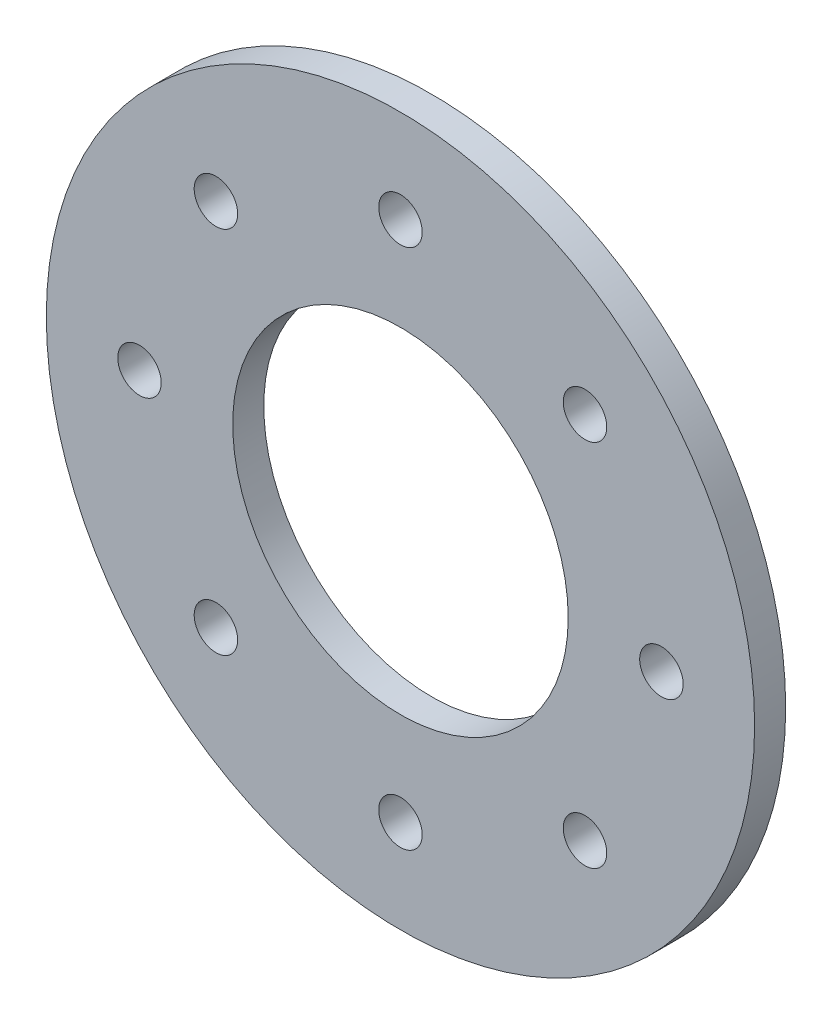
ISO-10303-21;
HEADER;
FILE_DESCRIPTION(('STEP AP214'),'2;1');
FILE_NAME('part.step','',(''),(''),'','','');
FILE_SCHEMA(('AUTOMOTIVE_DESIGN { 1 0 10303 214 1 1 1 1 }'));
ENDSEC;
DATA;
#1=APPLICATION_CONTEXT('core data for automotive mechanical design processes');
#2=APPLICATION_PROTOCOL_DEFINITION('international standard','automotive_design',2000,#1);
#3=PRODUCT_CONTEXT('',#1,'mechanical');
#4=PRODUCT('Part','Part','',(#3));
#5=PRODUCT_RELATED_PRODUCT_CATEGORY('part','',(#4));
#6=PRODUCT_DEFINITION_FORMATION('','',#4);
#7=PRODUCT_DEFINITION_CONTEXT('part definition',#1,'design');
#8=PRODUCT_DEFINITION('design','',#6,#7);
#9=PRODUCT_DEFINITION_SHAPE('','',#8);
#10=(LENGTH_UNIT() NAMED_UNIT(*) SI_UNIT(.MILLI.,.METRE.));
#11=(NAMED_UNIT(*) PLANE_ANGLE_UNIT() SI_UNIT($,.RADIAN.));
#12=(NAMED_UNIT(*) SI_UNIT($,.STERADIAN.) SOLID_ANGLE_UNIT());
#13=UNCERTAINTY_MEASURE_WITH_UNIT(LENGTH_MEASURE(1.E-05),#10,'distance_accuracy_value','');
#14=(GEOMETRIC_REPRESENTATION_CONTEXT(3) GLOBAL_UNCERTAINTY_ASSIGNED_CONTEXT((#13)) GLOBAL_UNIT_ASSIGNED_CONTEXT((#10,
#11,#12)) REPRESENTATION_CONTEXT('',''));
#15=CARTESIAN_POINT('',(0.,0.,0.));
#16=DIRECTION('',(0.,0.,1.));
#17=DIRECTION('',(1.,0.,0.));
#18=AXIS2_PLACEMENT_3D('',#15,#16,#17);
#19=CARTESIAN_POINT('',(0.,0.,5.));
#20=DIRECTION('',(0.,0.,1.));
#21=DIRECTION('',(1.,0.,0.));
#22=AXIS2_PLACEMENT_3D('',#19,#20,#21);
#23=PLANE('',#22);
#24=CARTESIAN_POINT('',(0.,-42.,5.));
#25=DIRECTION('',(0.,0.,1.));
#26=DIRECTION('',(1.,0.,0.));
#27=AXIS2_PLACEMENT_3D('',#24,#25,#26);
#28=CIRCLE('',#27,3.50000000000001);
#29=CARTESIAN_POINT('',(3.50000000000001,-42.,5.));
#30=VERTEX_POINT('',#29);
#31=EDGE_CURVE('E83',#30,#30,#28,.T.);
#32=ORIENTED_EDGE('',*,*,#31,.F.);
#33=EDGE_LOOP('',(#32));
#34=FACE_BOUND('',#33,.T.);
#35=CARTESIAN_POINT('',(42.,0.,5.));
#36=DIRECTION('',(0.,0.,1.));
#37=DIRECTION('',(1.,0.,0.));
#38=AXIS2_PLACEMENT_3D('',#35,#36,#37);
#39=CIRCLE('',#38,3.50000000000001);
#40=CARTESIAN_POINT('',(45.5,0.,5.));
#41=VERTEX_POINT('',#40);
#42=EDGE_CURVE('E71',#41,#41,#39,.T.);
#43=ORIENTED_EDGE('',*,*,#42,.F.);
#44=EDGE_LOOP('',(#43));
#45=FACE_BOUND('',#44,.T.);
#46=CARTESIAN_POINT('',(0.,42.,5.));
#47=DIRECTION('',(0.,0.,1.));
#48=DIRECTION('',(1.,0.,0.));
#49=AXIS2_PLACEMENT_3D('',#46,#47,#48);
#50=CIRCLE('',#49,3.50000000000001);
#51=CARTESIAN_POINT('',(3.5,42.,5.));
#52=VERTEX_POINT('',#51);
#53=EDGE_CURVE('E59',#52,#52,#50,.T.);
#54=ORIENTED_EDGE('',*,*,#53,.F.);
#55=EDGE_LOOP('',(#54));
#56=FACE_BOUND('',#55,.T.);
#57=CARTESIAN_POINT('',(-42.,0.,5.));
#58=DIRECTION('',(0.,0.,1.));
#59=DIRECTION('',(1.,0.,0.));
#60=AXIS2_PLACEMENT_3D('',#57,#58,#59);
#61=CIRCLE('',#60,3.50000000000001);
#62=CARTESIAN_POINT('',(-38.5,0.,5.));
#63=VERTEX_POINT('',#62);
#64=EDGE_CURVE('E47',#63,#63,#61,.T.);
#65=ORIENTED_EDGE('',*,*,#64,.F.);
#66=EDGE_LOOP('',(#65));
#67=FACE_BOUND('',#66,.T.);
#68=CARTESIAN_POINT('',(0.,0.,5.));
#69=DIRECTION('',(0.,0.,1.));
#70=DIRECTION('',(1.,0.,0.));
#71=AXIS2_PLACEMENT_3D('',#68,#69,#70);
#72=CIRCLE('',#71,57.);
#73=CARTESIAN_POINT('',(57.,0.,5.));
#74=VERTEX_POINT('',#73);
#75=EDGE_CURVE('E10',#74,#74,#72,.T.);
#76=ORIENTED_EDGE('',*,*,#75,.T.);
#77=EDGE_LOOP('',(#76));
#78=FACE_BOUND('',#77,.T.);
#79=CARTESIAN_POINT('',(0.,0.,5.));
#80=DIRECTION('',(0.,0.,1.));
#81=DIRECTION('',(1.,0.,0.));
#82=AXIS2_PLACEMENT_3D('',#79,#80,#81);
#83=CIRCLE('',#82,26.999999975);
#84=CARTESIAN_POINT('',(26.999999975,0.,5.));
#85=VERTEX_POINT('',#84);
#86=EDGE_CURVE('E42',#85,#85,#83,.T.);
#87=ORIENTED_EDGE('',*,*,#86,.F.);
#88=EDGE_LOOP('',(#87));
#89=FACE_BOUND('',#88,.T.);
#90=CARTESIAN_POINT('',(-29.698484809835,29.698484809835,5.));
#91=DIRECTION('',(0.,0.,1.));
#92=DIRECTION('',(1.,0.,0.));
#93=AXIS2_PLACEMENT_3D('',#90,#91,#92);
#94=CIRCLE('',#93,3.5);
#95=CARTESIAN_POINT('',(-26.198484809835,29.698484809835,5.));
#96=VERTEX_POINT('',#95);
#97=EDGE_CURVE('E53',#96,#96,#94,.T.);
#98=ORIENTED_EDGE('',*,*,#97,.F.);
#99=EDGE_LOOP('',(#98));
#100=FACE_BOUND('',#99,.T.);
#101=CARTESIAN_POINT('',(29.698484809835,29.698484809835,5.));
#102=DIRECTION('',(0.,0.,1.));
#103=DIRECTION('',(1.,0.,0.));
#104=AXIS2_PLACEMENT_3D('',#101,#102,#103);
#105=CIRCLE('',#104,3.5);
#106=CARTESIAN_POINT('',(33.198484809835,29.698484809835,5.));
#107=VERTEX_POINT('',#106);
#108=EDGE_CURVE('E65',#107,#107,#105,.T.);
#109=ORIENTED_EDGE('',*,*,#108,.F.);
#110=EDGE_LOOP('',(#109));
#111=FACE_BOUND('',#110,.T.);
#112=CARTESIAN_POINT('',(29.698484809835,-29.698484809835,5.));
#113=DIRECTION('',(0.,0.,1.));
#114=DIRECTION('',(1.,0.,0.));
#115=AXIS2_PLACEMENT_3D('',#112,#113,#114);
#116=CIRCLE('',#115,3.5);
#117=CARTESIAN_POINT('',(33.198484809835,-29.698484809835,5.));
#118=VERTEX_POINT('',#117);
#119=EDGE_CURVE('E77',#118,#118,#116,.T.);
#120=ORIENTED_EDGE('',*,*,#119,.F.);
#121=EDGE_LOOP('',(#120));
#122=FACE_BOUND('',#121,.T.);
#123=CARTESIAN_POINT('',(-29.698484809835,-29.698484809835,5.));
#124=DIRECTION('',(0.,0.,1.));
#125=DIRECTION('',(1.,0.,0.));
#126=AXIS2_PLACEMENT_3D('',#123,#124,#125);
#127=CIRCLE('',#126,3.49999999999999);
#128=CARTESIAN_POINT('',(-26.198484809835,-29.698484809835,5.));
#129=VERTEX_POINT('',#128);
#130=EDGE_CURVE('E89',#129,#129,#127,.T.);
#131=ORIENTED_EDGE('',*,*,#130,.F.);
#132=EDGE_LOOP('',(#131));
#133=FACE_BOUND('',#132,.T.);
#134=ADVANCED_FACE('F31',(#34,#45,#56,#67,#78,#89,#100,#111,#122,#133),#23,.T.);
#135=CARTESIAN_POINT('',(0.,0.,0.));
#136=DIRECTION('',(0.,0.,1.));
#137=DIRECTION('',(1.,0.,0.));
#138=AXIS2_PLACEMENT_3D('',#135,#136,#137);
#139=PLANE('',#138);
#140=CARTESIAN_POINT('',(0.,-42.,0.));
#141=DIRECTION('',(0.,0.,1.));
#142=DIRECTION('',(1.,0.,0.));
#143=AXIS2_PLACEMENT_3D('',#140,#141,#142);
#144=CIRCLE('',#143,3.50000000000001);
#145=CARTESIAN_POINT('',(3.50000000000001,-42.,0.));
#146=VERTEX_POINT('',#145);
#147=EDGE_CURVE('E86',#146,#146,#144,.T.);
#148=ORIENTED_EDGE('',*,*,#147,.T.);
#149=EDGE_LOOP('',(#148));
#150=FACE_BOUND('',#149,.T.);
#151=CARTESIAN_POINT('',(42.,0.,0.));
#152=DIRECTION('',(0.,0.,1.));
#153=DIRECTION('',(1.,0.,0.));
#154=AXIS2_PLACEMENT_3D('',#151,#152,#153);
#155=CIRCLE('',#154,3.50000000000001);
#156=CARTESIAN_POINT('',(45.5,0.,0.));
#157=VERTEX_POINT('',#156);
#158=EDGE_CURVE('E74',#157,#157,#155,.T.);
#159=ORIENTED_EDGE('',*,*,#158,.T.);
#160=EDGE_LOOP('',(#159));
#161=FACE_BOUND('',#160,.T.);
#162=CARTESIAN_POINT('',(0.,42.,0.));
#163=DIRECTION('',(0.,0.,1.));
#164=DIRECTION('',(1.,0.,0.));
#165=AXIS2_PLACEMENT_3D('',#162,#163,#164);
#166=CIRCLE('',#165,3.50000000000001);
#167=CARTESIAN_POINT('',(3.5,42.,0.));
#168=VERTEX_POINT('',#167);
#169=EDGE_CURVE('E62',#168,#168,#166,.T.);
#170=ORIENTED_EDGE('',*,*,#169,.T.);
#171=EDGE_LOOP('',(#170));
#172=FACE_BOUND('',#171,.T.);
#173=CARTESIAN_POINT('',(-42.,0.,0.));
#174=DIRECTION('',(0.,0.,1.));
#175=DIRECTION('',(1.,0.,0.));
#176=AXIS2_PLACEMENT_3D('',#173,#174,#175);
#177=CIRCLE('',#176,3.50000000000001);
#178=CARTESIAN_POINT('',(-38.5,0.,0.));
#179=VERTEX_POINT('',#178);
#180=EDGE_CURVE('E50',#179,#179,#177,.T.);
#181=ORIENTED_EDGE('',*,*,#180,.T.);
#182=EDGE_LOOP('',(#181));
#183=FACE_BOUND('',#182,.T.);
#184=CARTESIAN_POINT('',(0.,0.,0.));
#185=DIRECTION('',(0.,0.,1.));
#186=DIRECTION('',(1.,0.,0.));
#187=AXIS2_PLACEMENT_3D('',#184,#185,#186);
#188=CIRCLE('',#187,57.);
#189=CARTESIAN_POINT('',(57.,0.,0.));
#190=VERTEX_POINT('',#189);
#191=EDGE_CURVE('E35',#190,#190,#188,.T.);
#192=ORIENTED_EDGE('',*,*,#191,.F.);
#193=EDGE_LOOP('',(#192));
#194=FACE_BOUND('',#193,.T.);
#195=CARTESIAN_POINT('',(0.,0.,0.));
#196=DIRECTION('',(0.,0.,1.));
#197=DIRECTION('',(1.,0.,0.));
#198=AXIS2_PLACEMENT_3D('',#195,#196,#197);
#199=CIRCLE('',#198,26.999999975);
#200=CARTESIAN_POINT('',(26.999999975,0.,0.));
#201=VERTEX_POINT('',#200);
#202=EDGE_CURVE('E44',#201,#201,#199,.T.);
#203=ORIENTED_EDGE('',*,*,#202,.T.);
#204=EDGE_LOOP('',(#203));
#205=FACE_BOUND('',#204,.T.);
#206=CARTESIAN_POINT('',(-29.698484809835,29.698484809835,0.));
#207=DIRECTION('',(0.,0.,1.));
#208=DIRECTION('',(1.,0.,0.));
#209=AXIS2_PLACEMENT_3D('',#206,#207,#208);
#210=CIRCLE('',#209,3.5);
#211=CARTESIAN_POINT('',(-26.198484809835,29.698484809835,0.));
#212=VERTEX_POINT('',#211);
#213=EDGE_CURVE('E56',#212,#212,#210,.T.);
#214=ORIENTED_EDGE('',*,*,#213,.T.);
#215=EDGE_LOOP('',(#214));
#216=FACE_BOUND('',#215,.T.);
#217=CARTESIAN_POINT('',(29.698484809835,29.698484809835,0.));
#218=DIRECTION('',(0.,0.,1.));
#219=DIRECTION('',(1.,0.,0.));
#220=AXIS2_PLACEMENT_3D('',#217,#218,#219);
#221=CIRCLE('',#220,3.5);
#222=CARTESIAN_POINT('',(33.198484809835,29.698484809835,0.));
#223=VERTEX_POINT('',#222);
#224=EDGE_CURVE('E68',#223,#223,#221,.T.);
#225=ORIENTED_EDGE('',*,*,#224,.T.);
#226=EDGE_LOOP('',(#225));
#227=FACE_BOUND('',#226,.T.);
#228=CARTESIAN_POINT('',(29.698484809835,-29.698484809835,0.));
#229=DIRECTION('',(0.,0.,1.));
#230=DIRECTION('',(1.,0.,0.));
#231=AXIS2_PLACEMENT_3D('',#228,#229,#230);
#232=CIRCLE('',#231,3.5);
#233=CARTESIAN_POINT('',(33.198484809835,-29.698484809835,0.));
#234=VERTEX_POINT('',#233);
#235=EDGE_CURVE('E80',#234,#234,#232,.T.);
#236=ORIENTED_EDGE('',*,*,#235,.T.);
#237=EDGE_LOOP('',(#236));
#238=FACE_BOUND('',#237,.T.);
#239=CARTESIAN_POINT('',(-29.698484809835,-29.698484809835,0.));
#240=DIRECTION('',(0.,0.,1.));
#241=DIRECTION('',(1.,0.,0.));
#242=AXIS2_PLACEMENT_3D('',#239,#240,#241);
#243=CIRCLE('',#242,3.49999999999999);
#244=CARTESIAN_POINT('',(-26.198484809835,-29.698484809835,0.));
#245=VERTEX_POINT('',#244);
#246=EDGE_CURVE('E92',#245,#245,#243,.T.);
#247=ORIENTED_EDGE('',*,*,#246,.T.);
#248=EDGE_LOOP('',(#247));
#249=FACE_BOUND('',#248,.T.);
#250=ADVANCED_FACE('F102',(#150,#161,#172,#183,#194,#205,#216,#227,#238,#249),#139,.F.);
#251=CARTESIAN_POINT('',(0.,0.,5.));
#252=DIRECTION('',(0.,0.,-1.));
#253=DIRECTION('',(-1.,0.,0.));
#254=AXIS2_PLACEMENT_3D('',#251,#252,#253);
#255=CYLINDRICAL_SURFACE('',#254,57.);
#256=ORIENTED_EDGE('',*,*,#75,.F.);
#257=EDGE_LOOP('',(#256));
#258=FACE_BOUND('',#257,.T.);
#259=ORIENTED_EDGE('',*,*,#191,.T.);
#260=EDGE_LOOP('',(#259));
#261=FACE_BOUND('',#260,.T.);
#262=ADVANCED_FACE('F33',(#258,#261),#255,.T.);
#263=CARTESIAN_POINT('',(0.,0.,5.));
#264=DIRECTION('',(0.,0.,-1.));
#265=DIRECTION('',(-1.,0.,0.));
#266=AXIS2_PLACEMENT_3D('',#263,#264,#265);
#267=CYLINDRICAL_SURFACE('',#266,26.999999975);
#268=ORIENTED_EDGE('',*,*,#86,.T.);
#269=EDGE_LOOP('',(#268));
#270=FACE_BOUND('',#269,.T.);
#271=ORIENTED_EDGE('',*,*,#202,.F.);
#272=EDGE_LOOP('',(#271));
#273=FACE_BOUND('',#272,.T.);
#274=ADVANCED_FACE('F112',(#270,#273),#267,.F.);
#275=CARTESIAN_POINT('',(-42.,0.,5.));
#276=DIRECTION('',(0.,0.,-1.));
#277=DIRECTION('',(-1.,0.,0.));
#278=AXIS2_PLACEMENT_3D('',#275,#276,#277);
#279=CYLINDRICAL_SURFACE('',#278,3.50000000000001);
#280=ORIENTED_EDGE('',*,*,#64,.T.);
#281=EDGE_LOOP('',(#280));
#282=FACE_BOUND('',#281,.T.);
#283=ORIENTED_EDGE('',*,*,#180,.F.);
#284=EDGE_LOOP('',(#283));
#285=FACE_BOUND('',#284,.T.);
#286=ADVANCED_FACE('F115',(#282,#285),#279,.F.);
#287=CARTESIAN_POINT('',(-29.698484809835,29.698484809835,5.));
#288=DIRECTION('',(0.,0.,-1.));
#289=DIRECTION('',(-1.,0.,0.));
#290=AXIS2_PLACEMENT_3D('',#287,#288,#289);
#291=CYLINDRICAL_SURFACE('',#290,3.5);
#292=ORIENTED_EDGE('',*,*,#97,.T.);
#293=EDGE_LOOP('',(#292));
#294=FACE_BOUND('',#293,.T.);
#295=ORIENTED_EDGE('',*,*,#213,.F.);
#296=EDGE_LOOP('',(#295));
#297=FACE_BOUND('',#296,.T.);
#298=ADVANCED_FACE('F119',(#294,#297),#291,.F.);
#299=CARTESIAN_POINT('',(0.,42.,5.));
#300=DIRECTION('',(0.,0.,-1.));
#301=DIRECTION('',(-1.,0.,0.));
#302=AXIS2_PLACEMENT_3D('',#299,#300,#301);
#303=CYLINDRICAL_SURFACE('',#302,3.50000000000001);
#304=ORIENTED_EDGE('',*,*,#53,.T.);
#305=EDGE_LOOP('',(#304));
#306=FACE_BOUND('',#305,.T.);
#307=ORIENTED_EDGE('',*,*,#169,.F.);
#308=EDGE_LOOP('',(#307));
#309=FACE_BOUND('',#308,.T.);
#310=ADVANCED_FACE('F123',(#306,#309),#303,.F.);
#311=CARTESIAN_POINT('',(29.698484809835,29.698484809835,5.));
#312=DIRECTION('',(0.,0.,-1.));
#313=DIRECTION('',(-1.,0.,0.));
#314=AXIS2_PLACEMENT_3D('',#311,#312,#313);
#315=CYLINDRICAL_SURFACE('',#314,3.5);
#316=ORIENTED_EDGE('',*,*,#108,.T.);
#317=EDGE_LOOP('',(#316));
#318=FACE_BOUND('',#317,.T.);
#319=ORIENTED_EDGE('',*,*,#224,.F.);
#320=EDGE_LOOP('',(#319));
#321=FACE_BOUND('',#320,.T.);
#322=ADVANCED_FACE('F127',(#318,#321),#315,.F.);
#323=CARTESIAN_POINT('',(42.,0.,5.));
#324=DIRECTION('',(0.,0.,-1.));
#325=DIRECTION('',(-1.,0.,0.));
#326=AXIS2_PLACEMENT_3D('',#323,#324,#325);
#327=CYLINDRICAL_SURFACE('',#326,3.50000000000001);
#328=ORIENTED_EDGE('',*,*,#42,.T.);
#329=EDGE_LOOP('',(#328));
#330=FACE_BOUND('',#329,.T.);
#331=ORIENTED_EDGE('',*,*,#158,.F.);
#332=EDGE_LOOP('',(#331));
#333=FACE_BOUND('',#332,.T.);
#334=ADVANCED_FACE('F131',(#330,#333),#327,.F.);
#335=CARTESIAN_POINT('',(29.698484809835,-29.698484809835,5.));
#336=DIRECTION('',(0.,0.,-1.));
#337=DIRECTION('',(-1.,0.,0.));
#338=AXIS2_PLACEMENT_3D('',#335,#336,#337);
#339=CYLINDRICAL_SURFACE('',#338,3.5);
#340=ORIENTED_EDGE('',*,*,#119,.T.);
#341=EDGE_LOOP('',(#340));
#342=FACE_BOUND('',#341,.T.);
#343=ORIENTED_EDGE('',*,*,#235,.F.);
#344=EDGE_LOOP('',(#343));
#345=FACE_BOUND('',#344,.T.);
#346=ADVANCED_FACE('F135',(#342,#345),#339,.F.);
#347=CARTESIAN_POINT('',(0.,-42.,5.));
#348=DIRECTION('',(0.,0.,-1.));
#349=DIRECTION('',(-1.,0.,0.));
#350=AXIS2_PLACEMENT_3D('',#347,#348,#349);
#351=CYLINDRICAL_SURFACE('',#350,3.50000000000001);
#352=ORIENTED_EDGE('',*,*,#31,.T.);
#353=EDGE_LOOP('',(#352));
#354=FACE_BOUND('',#353,.T.);
#355=ORIENTED_EDGE('',*,*,#147,.F.);
#356=EDGE_LOOP('',(#355));
#357=FACE_BOUND('',#356,.T.);
#358=ADVANCED_FACE('F139',(#354,#357),#351,.F.);
#359=CARTESIAN_POINT('',(-29.698484809835,-29.698484809835,5.));
#360=DIRECTION('',(0.,0.,-1.));
#361=DIRECTION('',(-1.,0.,0.));
#362=AXIS2_PLACEMENT_3D('',#359,#360,#361);
#363=CYLINDRICAL_SURFACE('',#362,3.49999999999999);
#364=ORIENTED_EDGE('',*,*,#130,.T.);
#365=EDGE_LOOP('',(#364));
#366=FACE_BOUND('',#365,.T.);
#367=ORIENTED_EDGE('',*,*,#246,.F.);
#368=EDGE_LOOP('',(#367));
#369=FACE_BOUND('',#368,.T.);
#370=ADVANCED_FACE('F98',(#366,#369),#363,.F.);
#371=CLOSED_SHELL('',(#134,#250,#262,#274,#286,#298,#310,#322,#334,#346,#358,#370));
#372=MANIFOLD_SOLID_BREP('B2',#371);
#373=ADVANCED_BREP_SHAPE_REPRESENTATION('',(#18,#372),#14);
#374=SHAPE_DEFINITION_REPRESENTATION(#9,#373);
ENDSEC;
END-ISO-10303-21;
